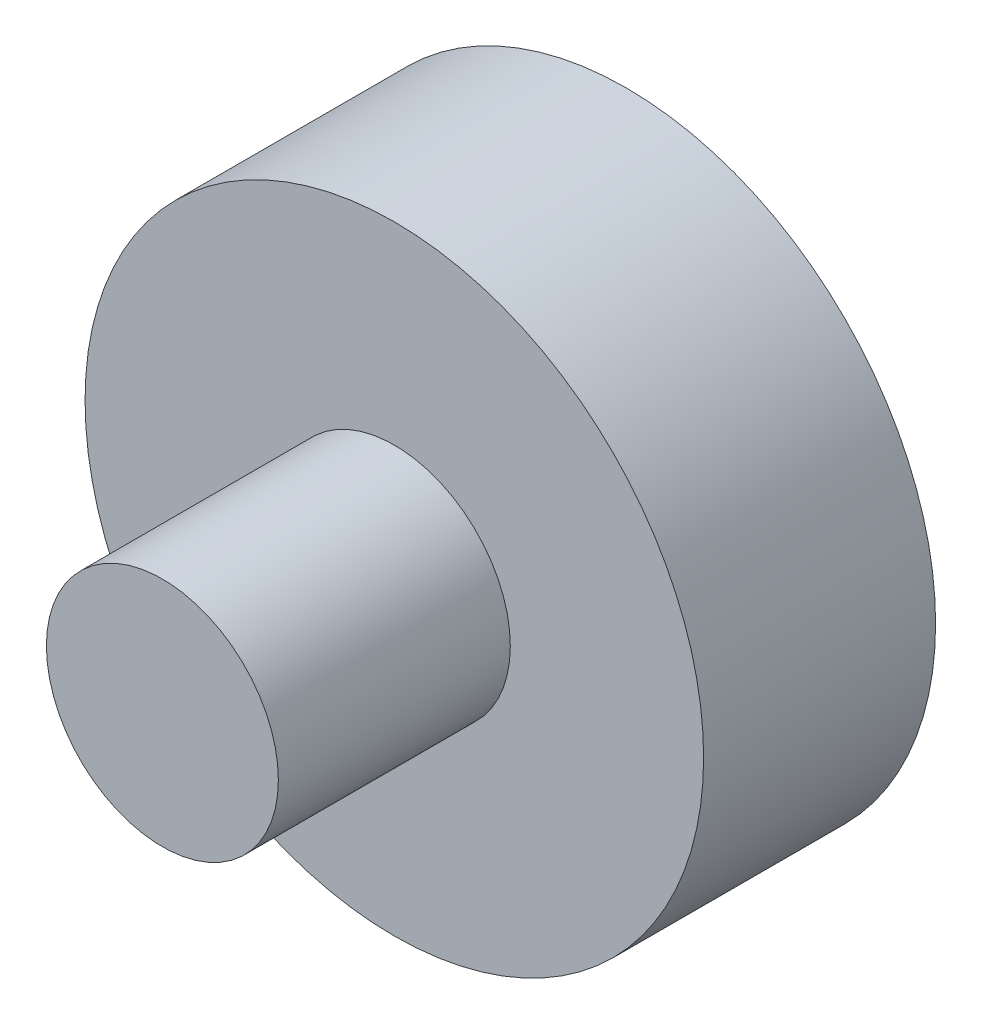
ISO-10303-21;
HEADER;
FILE_DESCRIPTION(('STEP AP214'),'2;1');
FILE_NAME('part.step','',(''),(''),'','','');
FILE_SCHEMA(('AUTOMOTIVE_DESIGN { 1 0 10303 214 1 1 1 1 }'));
ENDSEC;
DATA;
#1=APPLICATION_CONTEXT('core data for automotive mechanical design processes');
#2=APPLICATION_PROTOCOL_DEFINITION('international standard','automotive_design',2000,#1);
#3=PRODUCT_CONTEXT('',#1,'mechanical');
#4=PRODUCT('Part','Part','',(#3));
#5=PRODUCT_RELATED_PRODUCT_CATEGORY('part','',(#4));
#6=PRODUCT_DEFINITION_FORMATION('','',#4);
#7=PRODUCT_DEFINITION_CONTEXT('part definition',#1,'design');
#8=PRODUCT_DEFINITION('design','',#6,#7);
#9=PRODUCT_DEFINITION_SHAPE('','',#8);
#10=(LENGTH_UNIT() NAMED_UNIT(*) SI_UNIT(.MILLI.,.METRE.));
#11=(NAMED_UNIT(*) PLANE_ANGLE_UNIT() SI_UNIT($,.RADIAN.));
#12=(NAMED_UNIT(*) SI_UNIT($,.STERADIAN.) SOLID_ANGLE_UNIT());
#13=UNCERTAINTY_MEASURE_WITH_UNIT(LENGTH_MEASURE(1.E-05),#10,'distance_accuracy_value','');
#14=(GEOMETRIC_REPRESENTATION_CONTEXT(3) GLOBAL_UNCERTAINTY_ASSIGNED_CONTEXT((#13)) GLOBAL_UNIT_ASSIGNED_CONTEXT((#10,
#11,#12)) REPRESENTATION_CONTEXT('',''));
#15=CARTESIAN_POINT('',(0.,0.,0.));
#16=DIRECTION('',(0.,0.,1.));
#17=DIRECTION('',(1.,0.,0.));
#18=AXIS2_PLACEMENT_3D('',#15,#16,#17);
#19=CARTESIAN_POINT('',(0.,0.,19.05));
#20=DIRECTION('',(0.,0.,1.));
#21=DIRECTION('',(1.,0.,0.));
#22=AXIS2_PLACEMENT_3D('',#19,#20,#21);
#23=PLANE('',#22);
#24=CARTESIAN_POINT('',(0.,0.,19.05));
#25=DIRECTION('',(0.,0.,1.));
#26=DIRECTION('',(1.,0.,0.));
#27=AXIS2_PLACEMENT_3D('',#24,#25,#26);
#28=CIRCLE('',#27,25.4);
#29=CARTESIAN_POINT('',(25.4,0.,19.05));
#30=VERTEX_POINT('',#29);
#31=EDGE_CURVE('E10',#30,#30,#28,.T.);
#32=ORIENTED_EDGE('',*,*,#31,.T.);
#33=EDGE_LOOP('',(#32));
#34=FACE_BOUND('',#33,.T.);
#35=CARTESIAN_POINT('',(0.,0.,19.05));
#36=DIRECTION('',(0.,0.,1.));
#37=DIRECTION('',(1.,0.,0.));
#38=AXIS2_PLACEMENT_3D('',#35,#36,#37);
#39=CIRCLE('',#38,9.525);
#40=CARTESIAN_POINT('',(9.525,0.,19.05));
#41=VERTEX_POINT('',#40);
#42=EDGE_CURVE('E54',#41,#41,#39,.T.);
#43=ORIENTED_EDGE('',*,*,#42,.F.);
#44=EDGE_LOOP('',(#43));
#45=FACE_BOUND('',#44,.T.);
#46=ADVANCED_FACE('F38',(#34,#45),#23,.T.);
#47=CARTESIAN_POINT('',(0.,0.,19.05));
#48=DIRECTION('',(0.,0.,-1.));
#49=DIRECTION('',(-1.,0.,0.));
#50=AXIS2_PLACEMENT_3D('',#47,#48,#49);
#51=CYLINDRICAL_SURFACE('',#50,25.4);
#52=ORIENTED_EDGE('',*,*,#31,.F.);
#53=EDGE_LOOP('',(#52));
#54=FACE_BOUND('',#53,.T.);
#55=CARTESIAN_POINT('',(0.,0.,0.));
#56=DIRECTION('',(0.,0.,1.));
#57=DIRECTION('',(1.,0.,0.));
#58=AXIS2_PLACEMENT_3D('',#55,#56,#57);
#59=CIRCLE('',#58,25.4);
#60=CARTESIAN_POINT('',(25.4,0.,0.));
#61=VERTEX_POINT('',#60);
#62=EDGE_CURVE('E42',#61,#61,#59,.T.);
#63=ORIENTED_EDGE('',*,*,#62,.T.);
#64=EDGE_LOOP('',(#63));
#65=FACE_BOUND('',#64,.T.);
#66=ADVANCED_FACE('F40',(#54,#65),#51,.T.);
#67=CARTESIAN_POINT('',(0.,0.,0.));
#68=DIRECTION('',(0.,0.,1.));
#69=DIRECTION('',(1.,0.,0.));
#70=AXIS2_PLACEMENT_3D('',#67,#68,#69);
#71=PLANE('',#70);
#72=ORIENTED_EDGE('',*,*,#62,.F.);
#73=EDGE_LOOP('',(#72));
#74=FACE_BOUND('',#73,.T.);
#75=ADVANCED_FACE('F66',(#74),#71,.F.);
#76=CARTESIAN_POINT('',(0.,0.,38.1));
#77=DIRECTION('',(0.,0.,-1.));
#78=DIRECTION('',(-1.,0.,0.));
#79=AXIS2_PLACEMENT_3D('',#76,#77,#78);
#80=CYLINDRICAL_SURFACE('',#79,9.525);
#81=CARTESIAN_POINT('',(0.,0.,38.1));
#82=DIRECTION('',(0.,0.,1.));
#83=DIRECTION('',(1.,0.,0.));
#84=AXIS2_PLACEMENT_3D('',#81,#82,#83);
#85=CIRCLE('',#84,9.525);
#86=CARTESIAN_POINT('',(9.525,0.,38.1));
#87=VERTEX_POINT('',#86);
#88=EDGE_CURVE('E52',#87,#87,#85,.T.);
#89=ORIENTED_EDGE('',*,*,#88,.F.);
#90=EDGE_LOOP('',(#89));
#91=FACE_BOUND('',#90,.T.);
#92=ORIENTED_EDGE('',*,*,#42,.T.);
#93=EDGE_LOOP('',(#92));
#94=FACE_BOUND('',#93,.T.);
#95=ADVANCED_FACE('F63',(#91,#94),#80,.T.);
#96=CARTESIAN_POINT('',(0.,0.,38.1));
#97=DIRECTION('',(0.,0.,1.));
#98=DIRECTION('',(1.,0.,0.));
#99=AXIS2_PLACEMENT_3D('',#96,#97,#98);
#100=PLANE('',#99);
#101=ORIENTED_EDGE('',*,*,#88,.T.);
#102=EDGE_LOOP('',(#101));
#103=FACE_BOUND('',#102,.T.);
#104=ADVANCED_FACE('F61',(#103),#100,.T.);
#105=CLOSED_SHELL('',(#46,#66,#75,#95,#104));
#106=MANIFOLD_SOLID_BREP('B2',#105);
#107=ADVANCED_BREP_SHAPE_REPRESENTATION('',(#18,#106),#14);
#108=SHAPE_DEFINITION_REPRESENTATION(#9,#107);
ENDSEC;
END-ISO-10303-21;
